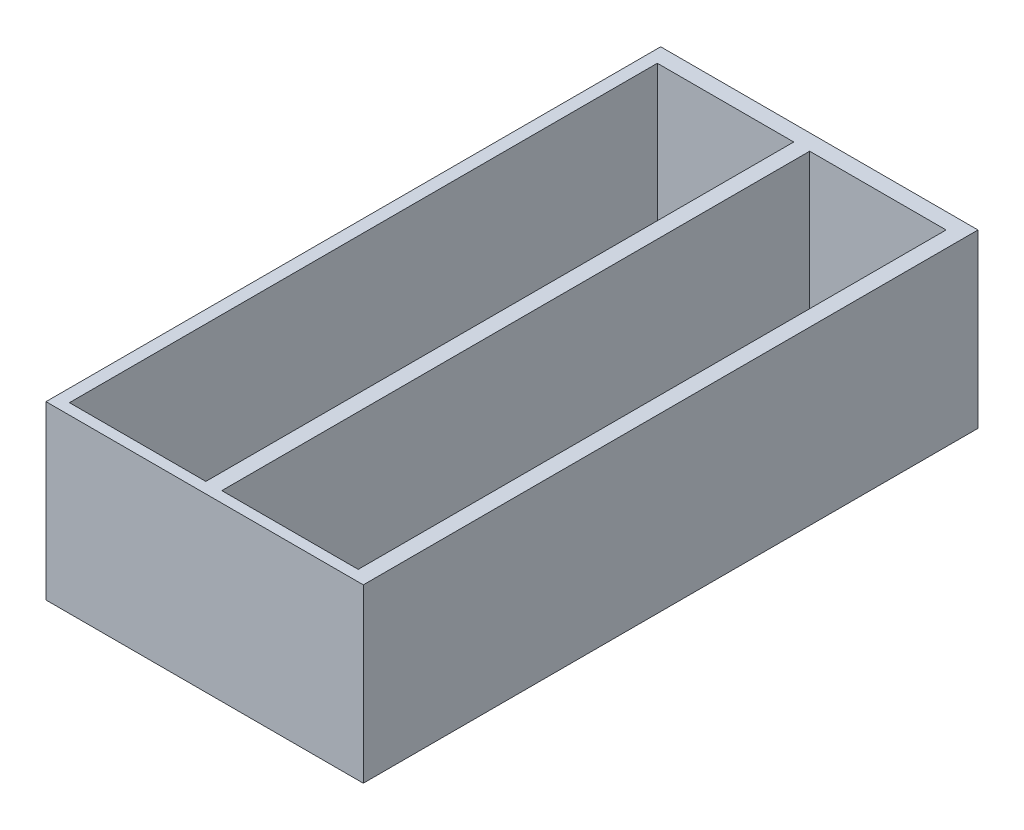
ISO-10303-21;
HEADER;
FILE_DESCRIPTION(('STEP AP214'),'2;1');
FILE_NAME('part.step','',(''),(''),'','','');
FILE_SCHEMA(('AUTOMOTIVE_DESIGN { 1 0 10303 214 1 1 1 1 }'));
ENDSEC;
DATA;
#1=APPLICATION_CONTEXT('core data for automotive mechanical design processes');
#2=APPLICATION_PROTOCOL_DEFINITION('international standard','automotive_design',2000,#1);
#3=PRODUCT_CONTEXT('',#1,'mechanical');
#4=PRODUCT('Part','Part','',(#3));
#5=PRODUCT_RELATED_PRODUCT_CATEGORY('part','',(#4));
#6=PRODUCT_DEFINITION_FORMATION('','',#4);
#7=PRODUCT_DEFINITION_CONTEXT('part definition',#1,'design');
#8=PRODUCT_DEFINITION('design','',#6,#7);
#9=PRODUCT_DEFINITION_SHAPE('','',#8);
#10=(LENGTH_UNIT() NAMED_UNIT(*) SI_UNIT(.MILLI.,.METRE.));
#11=(NAMED_UNIT(*) PLANE_ANGLE_UNIT() SI_UNIT($,.RADIAN.));
#12=(NAMED_UNIT(*) SI_UNIT($,.STERADIAN.) SOLID_ANGLE_UNIT());
#13=UNCERTAINTY_MEASURE_WITH_UNIT(LENGTH_MEASURE(1.E-05),#10,'distance_accuracy_value','');
#14=(GEOMETRIC_REPRESENTATION_CONTEXT(3) GLOBAL_UNCERTAINTY_ASSIGNED_CONTEXT((#13)) GLOBAL_UNIT_ASSIGNED_CONTEXT((#10,
#11,#12)) REPRESENTATION_CONTEXT('',''));
#15=CARTESIAN_POINT('',(0.,0.,0.));
#16=DIRECTION('',(0.,0.,1.));
#17=DIRECTION('',(1.,0.,0.));
#18=AXIS2_PLACEMENT_3D('',#15,#16,#17);
#19=CARTESIAN_POINT('',(-27.2717307692308,21.54,18.3833653846154));
#20=DIRECTION('',(1.,0.,0.));
#21=DIRECTION('',(0.,0.,-1.));
#22=AXIS2_PLACEMENT_3D('',#19,#20,#21);
#23=PLANE('',#22);
#24=DIRECTION('',(0.,0.,1.));
#25=VECTOR('',#24,1.);
#26=CARTESIAN_POINT('',(-27.2717307692308,0.,18.3833653846154));
#27=LINE('',#26,#25);
#28=CARTESIAN_POINT('',(-27.2717307692308,0.,-58.6766346153846));
#29=VERTEX_POINT('',#28);
#30=CARTESIAN_POINT('',(-27.2717307692308,0.,18.3833653846154));
#31=VERTEX_POINT('',#30);
#32=EDGE_CURVE('E174',#29,#31,#27,.T.);
#33=ORIENTED_EDGE('',*,*,#32,.T.);
#34=DIRECTION('',(0.,-1.,0.));
#35=VECTOR('',#34,1.);
#36=CARTESIAN_POINT('',(-27.2717307692308,21.54,18.3833653846154));
#37=LINE('',#36,#35);
#38=CARTESIAN_POINT('',(-27.2717307692308,21.54,18.3833653846154));
#39=VERTEX_POINT('',#38);
#40=EDGE_CURVE('E11',#39,#31,#37,.T.);
#41=ORIENTED_EDGE('',*,*,#40,.F.);
#42=DIRECTION('',(0.,0.,1.));
#43=VECTOR('',#42,1.);
#44=CARTESIAN_POINT('',(-27.2717307692308,21.54,18.3833653846154));
#45=LINE('',#44,#43);
#46=CARTESIAN_POINT('',(-27.2717307692308,21.54,-58.6766346153846));
#47=VERTEX_POINT('',#46);
#48=EDGE_CURVE('E221',#47,#39,#45,.T.);
#49=ORIENTED_EDGE('',*,*,#48,.F.);
#50=DIRECTION('',(0.,-1.,0.));
#51=VECTOR('',#50,1.);
#52=CARTESIAN_POINT('',(-27.2717307692308,21.54,-58.6766346153846));
#53=LINE('',#52,#51);
#54=EDGE_CURVE('E235',#47,#29,#53,.T.);
#55=ORIENTED_EDGE('',*,*,#54,.T.);
#56=EDGE_LOOP('',(#33,#41,#49,#55));
#57=FACE_BOUND('',#56,.T.);
#58=ADVANCED_FACE('F39',(#57),#23,.F.);
#59=CARTESIAN_POINT('',(-27.2717307692308,21.54,18.3833653846154));
#60=DIRECTION('',(0.,0.,-1.));
#61=DIRECTION('',(-1.,0.,0.));
#62=AXIS2_PLACEMENT_3D('',#59,#60,#61);
#63=PLANE('',#62);
#64=DIRECTION('',(1.,0.,0.));
#65=VECTOR('',#64,1.);
#66=CARTESIAN_POINT('',(-27.2717307692308,0.,18.3833653846154));
#67=LINE('',#66,#65);
#68=CARTESIAN_POINT('',(12.5082692307692,0.,18.3833653846154));
#69=VERTEX_POINT('',#68);
#70=EDGE_CURVE('E239',#31,#69,#67,.T.);
#71=ORIENTED_EDGE('',*,*,#70,.T.);
#72=DIRECTION('',(0.,-1.,0.));
#73=VECTOR('',#72,1.);
#74=CARTESIAN_POINT('',(12.5082692307692,21.54,18.3833653846154));
#75=LINE('',#74,#73);
#76=CARTESIAN_POINT('',(12.5082692307692,21.54,18.3833653846154));
#77=VERTEX_POINT('',#76);
#78=EDGE_CURVE('E47',#77,#69,#75,.T.);
#79=ORIENTED_EDGE('',*,*,#78,.F.);
#80=DIRECTION('',(1.,0.,0.));
#81=VECTOR('',#80,1.);
#82=CARTESIAN_POINT('',(-27.2717307692308,21.54,18.3833653846154));
#83=LINE('',#82,#81);
#84=EDGE_CURVE('E225',#39,#77,#83,.T.);
#85=ORIENTED_EDGE('',*,*,#84,.F.);
#86=ORIENTED_EDGE('',*,*,#40,.T.);
#87=EDGE_LOOP('',(#71,#79,#85,#86));
#88=FACE_BOUND('',#87,.T.);
#89=ADVANCED_FACE('F275',(#88),#63,.F.);
#90=CARTESIAN_POINT('',(12.5082692307692,21.54,18.3833653846154));
#91=DIRECTION('',(-1.,0.,0.));
#92=DIRECTION('',(0.,0.,1.));
#93=AXIS2_PLACEMENT_3D('',#90,#91,#92);
#94=PLANE('',#93);
#95=DIRECTION('',(0.,0.,-1.));
#96=VECTOR('',#95,1.);
#97=CARTESIAN_POINT('',(12.5082692307692,0.,18.3833653846154));
#98=LINE('',#97,#96);
#99=CARTESIAN_POINT('',(12.5082692307692,0.,-58.6766346153846));
#100=VERTEX_POINT('',#99);
#101=EDGE_CURVE('E242',#69,#100,#98,.T.);
#102=ORIENTED_EDGE('',*,*,#101,.T.);
#103=DIRECTION('',(0.,-1.,0.));
#104=VECTOR('',#103,1.);
#105=CARTESIAN_POINT('',(12.5082692307692,21.54,-58.6766346153846));
#106=LINE('',#105,#104);
#107=CARTESIAN_POINT('',(12.5082692307692,21.54,-58.6766346153846));
#108=VERTEX_POINT('',#107);
#109=EDGE_CURVE('E250',#108,#100,#106,.T.);
#110=ORIENTED_EDGE('',*,*,#109,.F.);
#111=DIRECTION('',(0.,0.,-1.));
#112=VECTOR('',#111,1.);
#113=CARTESIAN_POINT('',(12.5082692307692,21.54,18.3833653846154));
#114=LINE('',#113,#112);
#115=EDGE_CURVE('E229',#77,#108,#114,.T.);
#116=ORIENTED_EDGE('',*,*,#115,.F.);
#117=ORIENTED_EDGE('',*,*,#78,.T.);
#118=EDGE_LOOP('',(#102,#110,#116,#117));
#119=FACE_BOUND('',#118,.T.);
#120=ADVANCED_FACE('F259',(#119),#94,.F.);
#121=CARTESIAN_POINT('',(-27.2717307692308,21.54,-58.6766346153846));
#122=DIRECTION('',(0.,0.,1.));
#123=DIRECTION('',(1.,0.,0.));
#124=AXIS2_PLACEMENT_3D('',#121,#122,#123);
#125=PLANE('',#124);
#126=DIRECTION('',(-1.,0.,0.));
#127=VECTOR('',#126,1.);
#128=CARTESIAN_POINT('',(-27.2717307692308,0.,-58.6766346153846));
#129=LINE('',#128,#127);
#130=EDGE_CURVE('E226',#100,#29,#129,.T.);
#131=ORIENTED_EDGE('',*,*,#130,.T.);
#132=ORIENTED_EDGE('',*,*,#54,.F.);
#133=DIRECTION('',(-1.,0.,0.));
#134=VECTOR('',#133,1.);
#135=CARTESIAN_POINT('',(-27.2717307692308,21.54,-58.6766346153846));
#136=LINE('',#135,#134);
#137=EDGE_CURVE('E232',#108,#47,#136,.T.);
#138=ORIENTED_EDGE('',*,*,#137,.F.);
#139=ORIENTED_EDGE('',*,*,#109,.T.);
#140=EDGE_LOOP('',(#131,#132,#138,#139));
#141=FACE_BOUND('',#140,.T.);
#142=ADVANCED_FACE('F268',(#141),#125,.F.);
#143=CARTESIAN_POINT('',(0.,21.54,0.));
#144=DIRECTION('',(0.,-1.,0.));
#145=DIRECTION('',(0.,0.,-1.));
#146=AXIS2_PLACEMENT_3D('',#143,#144,#145);
#147=PLANE('',#146);
#148=DIRECTION('',(-1.,0.,0.));
#149=VECTOR('',#148,1.);
#150=CARTESIAN_POINT('',(10.5082692307692,21.54,-56.6766346153846));
#151=LINE('',#150,#149);
#152=CARTESIAN_POINT('',(10.5082692307692,21.54,-56.6766346153846));
#153=VERTEX_POINT('',#152);
#154=CARTESIAN_POINT('',(-6.59173076923079,21.54,-56.6766346153846));
#155=VERTEX_POINT('',#154);
#156=EDGE_CURVE('E164',#153,#155,#151,.T.);
#157=ORIENTED_EDGE('',*,*,#156,.F.);
#158=DIRECTION('',(0.,0.,-1.));
#159=VECTOR('',#158,1.);
#160=CARTESIAN_POINT('',(10.5082692307692,21.54,17.0233653846154));
#161=LINE('',#160,#159);
#162=CARTESIAN_POINT('',(10.5082692307692,21.54,17.0233653846154));
#163=VERTEX_POINT('',#162);
#164=EDGE_CURVE('E54',#163,#153,#161,.T.);
#165=ORIENTED_EDGE('',*,*,#164,.F.);
#166=DIRECTION('',(1.,0.,0.));
#167=VECTOR('',#166,1.);
#168=CARTESIAN_POINT('',(10.5082692307692,21.54,17.0233653846154));
#169=LINE('',#168,#167);
#170=CARTESIAN_POINT('',(-6.59173076923079,21.54,17.0233653846154));
#171=VERTEX_POINT('',#170);
#172=EDGE_CURVE('E151',#171,#163,#169,.T.);
#173=ORIENTED_EDGE('',*,*,#172,.F.);
#174=DIRECTION('',(0.,0.,1.));
#175=VECTOR('',#174,1.);
#176=CARTESIAN_POINT('',(-6.59173076923079,21.54,17.0233653846154));
#177=LINE('',#176,#175);
#178=EDGE_CURVE('E155',#155,#171,#177,.T.);
#179=ORIENTED_EDGE('',*,*,#178,.F.);
#180=EDGE_LOOP('',(#157,#165,#173,#179));
#181=FACE_BOUND('',#180,.T.);
#182=DIRECTION('',(-1.,0.,0.));
#183=VECTOR('',#182,1.);
#184=CARTESIAN_POINT('',(-8.59173076923077,21.54,-56.6766346153846));
#185=LINE('',#184,#183);
#186=CARTESIAN_POINT('',(-8.59173076923077,21.54,-56.6766346153846));
#187=VERTEX_POINT('',#186);
#188=CARTESIAN_POINT('',(-25.6917307692308,21.54,-56.6766346153846));
#189=VERTEX_POINT('',#188);
#190=EDGE_CURVE('E200',#187,#189,#185,.T.);
#191=ORIENTED_EDGE('',*,*,#190,.F.);
#192=DIRECTION('',(0.,0.,-1.));
#193=VECTOR('',#192,1.);
#194=CARTESIAN_POINT('',(-8.59173076923077,21.54,17.0233653846154));
#195=LINE('',#194,#193);
#196=CARTESIAN_POINT('',(-8.59173076923077,21.54,17.0233653846154));
#197=VERTEX_POINT('',#196);
#198=EDGE_CURVE('E62',#197,#187,#195,.T.);
#199=ORIENTED_EDGE('',*,*,#198,.F.);
#200=DIRECTION('',(1.,0.,0.));
#201=VECTOR('',#200,1.);
#202=CARTESIAN_POINT('',(-8.59173076923077,21.54,17.0233653846154));
#203=LINE('',#202,#201);
#204=CARTESIAN_POINT('',(-25.6917307692308,21.54,17.0233653846154));
#205=VERTEX_POINT('',#204);
#206=EDGE_CURVE('E185',#205,#197,#203,.T.);
#207=ORIENTED_EDGE('',*,*,#206,.F.);
#208=DIRECTION('',(0.,0.,1.));
#209=VECTOR('',#208,1.);
#210=CARTESIAN_POINT('',(-25.6917307692308,21.54,17.0233653846154));
#211=LINE('',#210,#209);
#212=EDGE_CURVE('E204',#189,#205,#211,.T.);
#213=ORIENTED_EDGE('',*,*,#212,.F.);
#214=EDGE_LOOP('',(#191,#199,#207,#213));
#215=FACE_BOUND('',#214,.T.);
#216=ORIENTED_EDGE('',*,*,#48,.T.);
#217=ORIENTED_EDGE('',*,*,#84,.T.);
#218=ORIENTED_EDGE('',*,*,#115,.T.);
#219=ORIENTED_EDGE('',*,*,#137,.T.);
#220=EDGE_LOOP('',(#216,#217,#218,#219));
#221=FACE_BOUND('',#220,.T.);
#222=ADVANCED_FACE('F274',(#181,#215,#221),#147,.F.);
#223=CARTESIAN_POINT('',(0.,0.,0.));
#224=DIRECTION('',(0.,-1.,0.));
#225=DIRECTION('',(0.,0.,-1.));
#226=AXIS2_PLACEMENT_3D('',#223,#224,#225);
#227=PLANE('',#226);
#228=ORIENTED_EDGE('',*,*,#32,.F.);
#229=ORIENTED_EDGE('',*,*,#130,.F.);
#230=ORIENTED_EDGE('',*,*,#101,.F.);
#231=ORIENTED_EDGE('',*,*,#70,.F.);
#232=EDGE_LOOP('',(#228,#229,#230,#231));
#233=FACE_BOUND('',#232,.T.);
#234=ADVANCED_FACE('F265',(#233),#227,.T.);
#235=CARTESIAN_POINT('',(-8.59173076923077,2.,17.0233653846154));
#236=DIRECTION('',(1.,0.,0.));
#237=DIRECTION('',(0.,0.,-1.));
#238=AXIS2_PLACEMENT_3D('',#235,#236,#237);
#239=PLANE('',#238);
#240=ORIENTED_EDGE('',*,*,#198,.T.);
#241=DIRECTION('',(0.,1.,0.));
#242=VECTOR('',#241,1.);
#243=CARTESIAN_POINT('',(-8.59173076923077,2.,-56.6766346153846));
#244=LINE('',#243,#242);
#245=CARTESIAN_POINT('',(-8.59173076923077,2.,-56.6766346153846));
#246=VERTEX_POINT('',#245);
#247=EDGE_CURVE('E197',#246,#187,#244,.T.);
#248=ORIENTED_EDGE('',*,*,#247,.F.);
#249=DIRECTION('',(0.,0.,-1.));
#250=VECTOR('',#249,1.);
#251=CARTESIAN_POINT('',(-8.59173076923077,2.,17.0233653846154));
#252=LINE('',#251,#250);
#253=CARTESIAN_POINT('',(-8.59173076923077,2.,17.0233653846154));
#254=VERTEX_POINT('',#253);
#255=EDGE_CURVE('E180',#254,#246,#252,.T.);
#256=ORIENTED_EDGE('',*,*,#255,.F.);
#257=DIRECTION('',(0.,1.,0.));
#258=VECTOR('',#257,1.);
#259=CARTESIAN_POINT('',(-8.59173076923077,2.,17.0233653846154));
#260=LINE('',#259,#258);
#261=EDGE_CURVE('E165',#254,#197,#260,.T.);
#262=ORIENTED_EDGE('',*,*,#261,.T.);
#263=EDGE_LOOP('',(#240,#248,#256,#262));
#264=FACE_BOUND('',#263,.T.);
#265=ADVANCED_FACE('F287',(#264),#239,.F.);
#266=CARTESIAN_POINT('',(-8.59173076923077,2.,17.0233653846154));
#267=DIRECTION('',(0.,0.,1.));
#268=DIRECTION('',(1.,0.,0.));
#269=AXIS2_PLACEMENT_3D('',#266,#267,#268);
#270=PLANE('',#269);
#271=ORIENTED_EDGE('',*,*,#206,.T.);
#272=ORIENTED_EDGE('',*,*,#261,.F.);
#273=DIRECTION('',(1.,0.,0.));
#274=VECTOR('',#273,1.);
#275=CARTESIAN_POINT('',(-8.59173076923077,2.,17.0233653846154));
#276=LINE('',#275,#274);
#277=CARTESIAN_POINT('',(-25.6917307692308,2.,17.0233653846154));
#278=VERTEX_POINT('',#277);
#279=EDGE_CURVE('E193',#278,#254,#276,.T.);
#280=ORIENTED_EDGE('',*,*,#279,.F.);
#281=DIRECTION('',(0.,1.,0.));
#282=VECTOR('',#281,1.);
#283=CARTESIAN_POINT('',(-25.6917307692308,2.,17.0233653846154));
#284=LINE('',#283,#282);
#285=EDGE_CURVE('E213',#278,#205,#284,.T.);
#286=ORIENTED_EDGE('',*,*,#285,.T.);
#287=EDGE_LOOP('',(#271,#272,#280,#286));
#288=FACE_BOUND('',#287,.T.);
#289=ADVANCED_FACE('F293',(#288),#270,.F.);
#290=CARTESIAN_POINT('',(-25.6917307692308,2.,17.0233653846154));
#291=DIRECTION('',(-1.,0.,0.));
#292=DIRECTION('',(0.,0.,1.));
#293=AXIS2_PLACEMENT_3D('',#290,#291,#292);
#294=PLANE('',#293);
#295=ORIENTED_EDGE('',*,*,#212,.T.);
#296=ORIENTED_EDGE('',*,*,#285,.F.);
#297=DIRECTION('',(0.,0.,1.));
#298=VECTOR('',#297,1.);
#299=CARTESIAN_POINT('',(-25.6917307692308,2.,17.0233653846154));
#300=LINE('',#299,#298);
#301=CARTESIAN_POINT('',(-25.6917307692308,2.,-56.6766346153846));
#302=VERTEX_POINT('',#301);
#303=EDGE_CURVE('E189',#302,#278,#300,.T.);
#304=ORIENTED_EDGE('',*,*,#303,.F.);
#305=DIRECTION('',(0.,1.,0.));
#306=VECTOR('',#305,1.);
#307=CARTESIAN_POINT('',(-25.6917307692308,2.,-56.6766346153846));
#308=LINE('',#307,#306);
#309=EDGE_CURVE('E216',#302,#189,#308,.T.);
#310=ORIENTED_EDGE('',*,*,#309,.T.);
#311=EDGE_LOOP('',(#295,#296,#304,#310));
#312=FACE_BOUND('',#311,.T.);
#313=ADVANCED_FACE('F298',(#312),#294,.F.);
#314=CARTESIAN_POINT('',(-8.59173076923077,2.,-56.6766346153846));
#315=DIRECTION('',(0.,0.,-1.));
#316=DIRECTION('',(-1.,0.,0.));
#317=AXIS2_PLACEMENT_3D('',#314,#315,#316);
#318=PLANE('',#317);
#319=ORIENTED_EDGE('',*,*,#190,.T.);
#320=ORIENTED_EDGE('',*,*,#309,.F.);
#321=DIRECTION('',(-1.,0.,0.));
#322=VECTOR('',#321,1.);
#323=CARTESIAN_POINT('',(-8.59173076923077,2.,-56.6766346153846));
#324=LINE('',#323,#322);
#325=EDGE_CURVE('E184',#246,#302,#324,.T.);
#326=ORIENTED_EDGE('',*,*,#325,.F.);
#327=ORIENTED_EDGE('',*,*,#247,.T.);
#328=EDGE_LOOP('',(#319,#320,#326,#327));
#329=FACE_BOUND('',#328,.T.);
#330=ADVANCED_FACE('F294',(#329),#318,.F.);
#331=CARTESIAN_POINT('',(0.,2.,0.));
#332=DIRECTION('',(0.,1.,0.));
#333=DIRECTION('',(0.,0.,1.));
#334=AXIS2_PLACEMENT_3D('',#331,#332,#333);
#335=PLANE('',#334);
#336=ORIENTED_EDGE('',*,*,#255,.T.);
#337=ORIENTED_EDGE('',*,*,#325,.T.);
#338=ORIENTED_EDGE('',*,*,#303,.T.);
#339=ORIENTED_EDGE('',*,*,#279,.T.);
#340=EDGE_LOOP('',(#336,#337,#338,#339));
#341=FACE_BOUND('',#340,.T.);
#342=ADVANCED_FACE('F297',(#341),#335,.T.);
#343=CARTESIAN_POINT('',(10.5082692307692,2.,17.0233653846154));
#344=DIRECTION('',(1.,0.,0.));
#345=DIRECTION('',(0.,0.,-1.));
#346=AXIS2_PLACEMENT_3D('',#343,#344,#345);
#347=PLANE('',#346);
#348=ORIENTED_EDGE('',*,*,#164,.T.);
#349=DIRECTION('',(0.,1.,0.));
#350=VECTOR('',#349,1.);
#351=CARTESIAN_POINT('',(10.5082692307692,2.,-56.6766346153846));
#352=LINE('',#351,#350);
#353=CARTESIAN_POINT('',(10.5082692307692,2.,-56.6766346153846));
#354=VERTEX_POINT('',#353);
#355=EDGE_CURVE('E126',#354,#153,#352,.T.);
#356=ORIENTED_EDGE('',*,*,#355,.F.);
#357=DIRECTION('',(0.,0.,-1.));
#358=VECTOR('',#357,1.);
#359=CARTESIAN_POINT('',(10.5082692307692,2.,17.0233653846154));
#360=LINE('',#359,#358);
#361=CARTESIAN_POINT('',(10.5082692307692,2.,17.0233653846154));
#362=VERTEX_POINT('',#361);
#363=EDGE_CURVE('E130',#362,#354,#360,.T.);
#364=ORIENTED_EDGE('',*,*,#363,.F.);
#365=DIRECTION('',(0.,1.,0.));
#366=VECTOR('',#365,1.);
#367=CARTESIAN_POINT('',(10.5082692307692,2.,17.0233653846154));
#368=LINE('',#367,#366);
#369=EDGE_CURVE('E171',#362,#163,#368,.T.);
#370=ORIENTED_EDGE('',*,*,#369,.T.);
#371=EDGE_LOOP('',(#348,#356,#364,#370));
#372=FACE_BOUND('',#371,.T.);
#373=ADVANCED_FACE('F128',(#372),#347,.F.);
#374=CARTESIAN_POINT('',(10.5082692307692,2.,17.0233653846154));
#375=DIRECTION('',(0.,0.,1.));
#376=DIRECTION('',(1.,0.,0.));
#377=AXIS2_PLACEMENT_3D('',#374,#375,#376);
#378=PLANE('',#377);
#379=ORIENTED_EDGE('',*,*,#172,.T.);
#380=ORIENTED_EDGE('',*,*,#369,.F.);
#381=DIRECTION('',(1.,0.,0.));
#382=VECTOR('',#381,1.);
#383=CARTESIAN_POINT('',(10.5082692307692,2.,17.0233653846154));
#384=LINE('',#383,#382);
#385=CARTESIAN_POINT('',(-6.59173076923079,2.,17.0233653846154));
#386=VERTEX_POINT('',#385);
#387=EDGE_CURVE('E137',#386,#362,#384,.T.);
#388=ORIENTED_EDGE('',*,*,#387,.F.);
#389=DIRECTION('',(0.,1.,0.));
#390=VECTOR('',#389,1.);
#391=CARTESIAN_POINT('',(-6.59173076923079,2.,17.0233653846154));
#392=LINE('',#391,#390);
#393=EDGE_CURVE('E175',#386,#171,#392,.T.);
#394=ORIENTED_EDGE('',*,*,#393,.T.);
#395=EDGE_LOOP('',(#379,#380,#388,#394));
#396=FACE_BOUND('',#395,.T.);
#397=ADVANCED_FACE('F311',(#396),#378,.F.);
#398=CARTESIAN_POINT('',(-6.59173076923079,2.,17.0233653846154));
#399=DIRECTION('',(-1.,0.,0.));
#400=DIRECTION('',(0.,0.,1.));
#401=AXIS2_PLACEMENT_3D('',#398,#399,#400);
#402=PLANE('',#401);
#403=ORIENTED_EDGE('',*,*,#178,.T.);
#404=ORIENTED_EDGE('',*,*,#393,.F.);
#405=DIRECTION('',(0.,0.,1.));
#406=VECTOR('',#405,1.);
#407=CARTESIAN_POINT('',(-6.59173076923079,2.,17.0233653846154));
#408=LINE('',#407,#406);
#409=CARTESIAN_POINT('',(-6.59173076923079,2.,-56.6766346153846));
#410=VERTEX_POINT('',#409);
#411=EDGE_CURVE('E146',#410,#386,#408,.T.);
#412=ORIENTED_EDGE('',*,*,#411,.F.);
#413=DIRECTION('',(0.,1.,0.));
#414=VECTOR('',#413,1.);
#415=CARTESIAN_POINT('',(-6.59173076923079,2.,-56.6766346153846));
#416=LINE('',#415,#414);
#417=EDGE_CURVE('E136',#410,#155,#416,.T.);
#418=ORIENTED_EDGE('',*,*,#417,.T.);
#419=EDGE_LOOP('',(#403,#404,#412,#418));
#420=FACE_BOUND('',#419,.T.);
#421=ADVANCED_FACE('F314',(#420),#402,.F.);
#422=CARTESIAN_POINT('',(10.5082692307692,2.,-56.6766346153846));
#423=DIRECTION('',(0.,0.,-1.));
#424=DIRECTION('',(-1.,0.,0.));
#425=AXIS2_PLACEMENT_3D('',#422,#423,#424);
#426=PLANE('',#425);
#427=ORIENTED_EDGE('',*,*,#156,.T.);
#428=ORIENTED_EDGE('',*,*,#417,.F.);
#429=DIRECTION('',(-1.,0.,0.));
#430=VECTOR('',#429,1.);
#431=CARTESIAN_POINT('',(10.5082692307692,2.,-56.6766346153846));
#432=LINE('',#431,#430);
#433=EDGE_CURVE('E140',#354,#410,#432,.T.);
#434=ORIENTED_EDGE('',*,*,#433,.F.);
#435=ORIENTED_EDGE('',*,*,#355,.T.);
#436=EDGE_LOOP('',(#427,#428,#434,#435));
#437=FACE_BOUND('',#436,.T.);
#438=ADVANCED_FACE('F141',(#437),#426,.F.);
#439=CARTESIAN_POINT('',(0.,2.,0.));
#440=DIRECTION('',(0.,1.,0.));
#441=DIRECTION('',(0.,0.,1.));
#442=AXIS2_PLACEMENT_3D('',#439,#440,#441);
#443=PLANE('',#442);
#444=ORIENTED_EDGE('',*,*,#363,.T.);
#445=ORIENTED_EDGE('',*,*,#433,.T.);
#446=ORIENTED_EDGE('',*,*,#411,.T.);
#447=ORIENTED_EDGE('',*,*,#387,.T.);
#448=EDGE_LOOP('',(#444,#445,#446,#447));
#449=FACE_BOUND('',#448,.T.);
#450=ADVANCED_FACE('F148',(#449),#443,.T.);
#451=CLOSED_SHELL('',(#58,#89,#120,#142,#222,#234,#265,#289,#313,#330,#342,#373,#397,#421,#438,#450));
#452=MANIFOLD_SOLID_BREP('B2',#451);
#453=ADVANCED_BREP_SHAPE_REPRESENTATION('',(#18,#452),#14);
#454=SHAPE_DEFINITION_REPRESENTATION(#9,#453);
ENDSEC;
END-ISO-10303-21;
